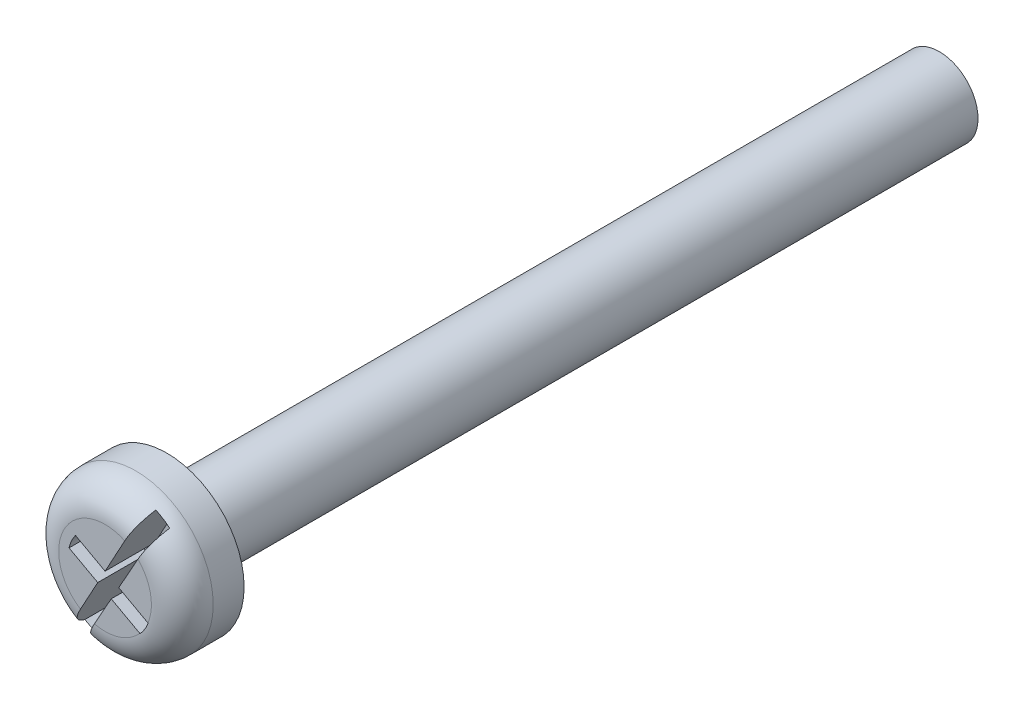
ISO-10303-21;
HEADER;
FILE_DESCRIPTION(('STEP AP214'),'2;1');
FILE_NAME('part.step','',(''),(''),'','','');
FILE_SCHEMA(('AUTOMOTIVE_DESIGN { 1 0 10303 214 1 1 1 1 }'));
ENDSEC;
DATA;
#1=APPLICATION_CONTEXT('core data for automotive mechanical design processes');
#2=APPLICATION_PROTOCOL_DEFINITION('international standard','automotive_design',2000,#1);
#3=PRODUCT_CONTEXT('',#1,'mechanical');
#4=PRODUCT('Part','Part','',(#3));
#5=PRODUCT_RELATED_PRODUCT_CATEGORY('part','',(#4));
#6=PRODUCT_DEFINITION_FORMATION('','',#4);
#7=PRODUCT_DEFINITION_CONTEXT('part definition',#1,'design');
#8=PRODUCT_DEFINITION('design','',#6,#7);
#9=PRODUCT_DEFINITION_SHAPE('','',#8);
#10=(LENGTH_UNIT() NAMED_UNIT(*) SI_UNIT(.MILLI.,.METRE.));
#11=(NAMED_UNIT(*) PLANE_ANGLE_UNIT() SI_UNIT($,.RADIAN.));
#12=(NAMED_UNIT(*) SI_UNIT($,.STERADIAN.) SOLID_ANGLE_UNIT());
#13=UNCERTAINTY_MEASURE_WITH_UNIT(LENGTH_MEASURE(1.E-05),#10,'distance_accuracy_value','');
#14=(GEOMETRIC_REPRESENTATION_CONTEXT(3) GLOBAL_UNCERTAINTY_ASSIGNED_CONTEXT((#13)) GLOBAL_UNIT_ASSIGNED_CONTEXT((#10,
#11,#12)) REPRESENTATION_CONTEXT('',''));
#15=CARTESIAN_POINT('',(0.,0.,0.));
#16=DIRECTION('',(0.,0.,1.));
#17=DIRECTION('',(1.,0.,0.));
#18=AXIS2_PLACEMENT_3D('',#15,#16,#17);
#19=CARTESIAN_POINT('',(-1.86051624597212,2.73214285714287,2.4));
#20=DIRECTION('',(0.,0.,1.));
#21=DIRECTION('',(1.,0.,0.));
#22=AXIS2_PLACEMENT_3D('',#19,#20,#21);
#23=PLANE('',#22);
#24=DIRECTION('',(-0.478292119632489,-0.87820080180871,0.));
#25=VECTOR('',#24,1.);
#26=CARTESIAN_POINT('',(-3.33454353016391,0.250826496084395,2.4));
#27=LINE('',#26,#25);
#28=CARTESIAN_POINT('',(-2.14514294385762,2.43470640062586,2.4));
#29=VERTEX_POINT('',#28);
#30=CARTESIAN_POINT('',(-2.8144800366458,1.20572447213714,2.4));
#31=VERTEX_POINT('',#30);
#32=EDGE_CURVE('E164',#29,#31,#27,.T.);
#33=ORIENTED_EDGE('',*,*,#32,.F.);
#34=DIRECTION('',(0.877616803209732,-0.479362854968896,0.));
#35=VECTOR('',#34,1.);
#36=CARTESIAN_POINT('',(-2.14514294385762,2.43470640062586,2.4));
#37=LINE('',#36,#35);
#38=CARTESIAN_POINT('',(-3.25868789679237,3.04293551135249,2.4));
#39=VERTEX_POINT('',#38);
#40=EDGE_CURVE('E166',#39,#29,#37,.T.);
#41=ORIENTED_EDGE('',*,*,#40,.F.);
#42=CARTESIAN_POINT('',(-1.86051624597212,2.73214285714287,2.4));
#43=DIRECTION('',(0.,0.,1.));
#44=DIRECTION('',(1.,0.,0.));
#45=AXIS2_PLACEMENT_3D('',#42,#43,#44);
#46=CIRCLE('',#45,1.43229746877807);
#47=CARTESIAN_POINT('',(-3.00946383602339,3.58735948138695,2.4));
#48=VERTEX_POINT('',#47);
#49=EDGE_CURVE('E207',#48,#39,#46,.T.);
#50=ORIENTED_EDGE('',*,*,#49,.F.);
#51=DIRECTION('',(-0.87756139574922,0.479464280933086,0.));
#52=VECTOR('',#51,1.);
#53=CARTESIAN_POINT('',(-1.85954831796557,2.95909185285404,2.4));
#54=LINE('',#53,#52);
#55=CARTESIAN_POINT('',(-1.85954831796557,2.95909185285404,2.4));
#56=VERTEX_POINT('',#55);
#57=EDGE_CURVE('E204',#56,#48,#54,.T.);
#58=ORIENTED_EDGE('',*,*,#57,.F.);
#59=DIRECTION('',(-0.478292119632489,-0.87820080180871,0.));
#60=VECTOR('',#59,1.);
#61=CARTESIAN_POINT('',(-1.85954831796557,2.95909185285404,2.4));
#62=LINE('',#61,#60);
#63=CARTESIAN_POINT('',(-1.09571318629089,4.36158333776873,2.4));
#64=VERTEX_POINT('',#63);
#65=EDGE_CURVE('E202',#64,#56,#62,.T.);
#66=ORIENTED_EDGE('',*,*,#65,.F.);
#67=CARTESIAN_POINT('',(-1.86051624597212,2.73214285714287,2.4));
#68=DIRECTION('',(0.,0.,1.));
#69=DIRECTION('',(1.,0.,0.));
#70=AXIS2_PLACEMENT_3D('',#67,#68,#69);
#71=CIRCLE('',#70,1.8);
#72=EDGE_CURVE('E252',#64,#31,#71,.T.);
#73=ORIENTED_EDGE('',*,*,#72,.T.);
#74=EDGE_LOOP('',(#33,#41,#50,#58,#66,#73));
#75=FACE_BOUND('',#74,.T.);
#76=ADVANCED_FACE('F32',(#75),#23,.T.);
#77=DIRECTION('',(0.488945551082672,0.872314305784596,0.));
#78=VECTOR('',#77,1.);
#79=CARTESIAN_POINT('',(-1.32937302466549,2.66942537823253,2.4));
#80=LINE('',#79,#78);
#81=CARTESIAN_POINT('',(-1.32937302466549,2.66942537823253,2.4));
#82=VERTEX_POINT('',#81);
#83=CARTESIAN_POINT('',(-0.583292168991765,4.00048770661469,2.4));
#84=VERTEX_POINT('',#83);
#85=EDGE_CURVE('E200',#82,#84,#80,.T.);
#86=ORIENTED_EDGE('',*,*,#85,.F.);
#87=DIRECTION('',(-0.87756139574922,0.479464280933086,0.));
#88=VECTOR('',#87,1.);
#89=CARTESIAN_POINT('',(-0.183967514701797,2.04362183688296,2.4));
#90=LINE('',#89,#88);
#91=CARTESIAN_POINT('',(-0.194936591049152,2.04961489939557,2.4));
#92=VERTEX_POINT('',#91);
#93=EDGE_CURVE('E198',#92,#82,#90,.T.);
#94=ORIENTED_EDGE('',*,*,#93,.F.);
#95=EDGE_CURVE('E248',#92,#84,#71,.T.);
#96=ORIENTED_EDGE('',*,*,#95,.T.);
#97=EDGE_LOOP('',(#86,#94,#96));
#98=FACE_BOUND('',#97,.T.);
#99=ADVANCED_FACE('F287',(#98),#23,.T.);
#100=CARTESIAN_POINT('',(-1.86051624597212,2.73214285714287,2.4));
#101=DIRECTION('',(0.,0.,-1.));
#102=DIRECTION('',(-1.,0.,0.));
#103=AXIS2_PLACEMENT_3D('',#100,#101,#102);
#104=CYLINDRICAL_SURFACE('',#103,3.);
#105=CARTESIAN_POINT('',(-1.86051624597212,2.73214285714287,1.2));
#106=DIRECTION('',(0.,0.,1.));
#107=DIRECTION('',(1.,0.,0.));
#108=AXIS2_PLACEMENT_3D('',#105,#106,#107);
#109=CIRCLE('',#108,3.);
#110=CARTESIAN_POINT('',(1.13948375402788,2.73214285714287,1.2));
#111=VERTEX_POINT('',#110);
#112=EDGE_CURVE('E253',#111,#111,#109,.F.);
#113=ORIENTED_EDGE('',*,*,#112,.T.);
#114=EDGE_LOOP('',(#113));
#115=FACE_BOUND('',#114,.T.);
#116=CARTESIAN_POINT('',(-1.86051624597212,2.73214285714287,0.));
#117=DIRECTION('',(0.,0.,1.));
#118=DIRECTION('',(1.,0.,0.));
#119=AXIS2_PLACEMENT_3D('',#116,#117,#118);
#120=CIRCLE('',#119,3.);
#121=CARTESIAN_POINT('',(1.13948375402788,2.73214285714287,0.));
#122=VERTEX_POINT('',#121);
#123=EDGE_CURVE('E242',#122,#122,#120,.T.);
#124=ORIENTED_EDGE('',*,*,#123,.T.);
#125=EDGE_LOOP('',(#124));
#126=FACE_BOUND('',#125,.T.);
#127=ADVANCED_FACE('F285',(#115,#126),#104,.T.);
#128=DIRECTION('',(0.877616803209732,-0.479362854968895,0.));
#129=VECTOR('',#128,1.);
#130=CARTESIAN_POINT('',(-0.499159615510704,1.53565425779784,2.4));
#131=LINE('',#130,#129);
#132=CARTESIAN_POINT('',(-1.62131210840641,2.14858489077753,2.4));
#133=VERTEX_POINT('',#132);
#134=CARTESIAN_POINT('',(-0.510336160729363,1.54175899577131,2.4));
#135=VERTEX_POINT('',#134);
#136=EDGE_CURVE('E196',#133,#135,#131,.T.);
#137=ORIENTED_EDGE('',*,*,#136,.F.);
#138=DIRECTION('',(0.488945551082672,0.872314305784596,0.));
#139=VECTOR('',#138,1.);
#140=CARTESIAN_POINT('',(-2.81993360779638,0.0101572502690064,2.4));
#141=LINE('',#140,#139);
#142=CARTESIAN_POINT('',(-2.27591252151725,0.980730303155878,2.4));
#143=VERTEX_POINT('',#142);
#144=EDGE_CURVE('E194',#143,#133,#141,.T.);
#145=ORIENTED_EDGE('',*,*,#144,.F.);
#146=EDGE_CURVE('E251',#143,#135,#71,.T.);
#147=ORIENTED_EDGE('',*,*,#146,.T.);
#148=EDGE_LOOP('',(#137,#145,#147));
#149=FACE_BOUND('',#148,.T.);
#150=ADVANCED_FACE('F282',(#149),#23,.T.);
#151=CARTESIAN_POINT('',(-1.86051624597212,2.73214285714287,0.));
#152=DIRECTION('',(0.,0.,1.));
#153=DIRECTION('',(1.,0.,0.));
#154=AXIS2_PLACEMENT_3D('',#151,#152,#153);
#155=PLANE('',#154);
#156=CARTESIAN_POINT('',(-1.86051624597212,2.73214285714287,0.));
#157=DIRECTION('',(0.,0.,1.));
#158=DIRECTION('',(1.,0.,0.));
#159=AXIS2_PLACEMENT_3D('',#156,#157,#158);
#160=CIRCLE('',#159,1.5);
#161=CARTESIAN_POINT('',(-0.360516245972119,2.73214285714287,0.));
#162=VERTEX_POINT('',#161);
#163=EDGE_CURVE('E245',#162,#162,#160,.F.);
#164=ORIENTED_EDGE('',*,*,#163,.F.);
#165=EDGE_LOOP('',(#164));
#166=FACE_BOUND('',#165,.T.);
#167=ORIENTED_EDGE('',*,*,#123,.F.);
#168=EDGE_LOOP('',(#167));
#169=FACE_BOUND('',#168,.T.);
#170=ADVANCED_FACE('F280',(#166,#169),#155,.F.);
#171=CARTESIAN_POINT('',(-1.86051624597212,2.73214285714287,-30.));
#172=DIRECTION('',(0.,0.,1.));
#173=DIRECTION('',(1.,0.,0.));
#174=AXIS2_PLACEMENT_3D('',#171,#172,#173);
#175=CYLINDRICAL_SURFACE('',#174,1.5);
#176=CARTESIAN_POINT('',(-1.86051624597212,2.73214285714287,-30.));
#177=DIRECTION('',(0.,0.,-1.));
#178=DIRECTION('',(-1.,0.,0.));
#179=AXIS2_PLACEMENT_3D('',#176,#177,#178);
#180=CIRCLE('',#179,1.5);
#181=CARTESIAN_POINT('',(-3.36051624597212,2.73214285714287,-30.));
#182=VERTEX_POINT('',#181);
#183=EDGE_CURVE('E214',#182,#182,#180,.T.);
#184=ORIENTED_EDGE('',*,*,#183,.F.);
#185=EDGE_LOOP('',(#184));
#186=FACE_BOUND('',#185,.T.);
#187=ORIENTED_EDGE('',*,*,#163,.T.);
#188=EDGE_LOOP('',(#187));
#189=FACE_BOUND('',#188,.T.);
#190=ADVANCED_FACE('F276',(#186,#189),#175,.T.);
#191=CARTESIAN_POINT('',(-1.86051624597212,2.73214285714287,-30.));
#192=DIRECTION('',(0.,0.,-1.));
#193=DIRECTION('',(-1.,0.,0.));
#194=AXIS2_PLACEMENT_3D('',#191,#192,#193);
#195=PLANE('',#194);
#196=ORIENTED_EDGE('',*,*,#183,.T.);
#197=EDGE_LOOP('',(#196));
#198=FACE_BOUND('',#197,.T.);
#199=ADVANCED_FACE('F273',(#198),#195,.T.);
#200=CARTESIAN_POINT('',(-1.86051624597212,2.73214285714287,1.2));
#201=DIRECTION('',(0.,0.,1.));
#202=DIRECTION('',(1.,0.,0.));
#203=AXIS2_PLACEMENT_3D('',#200,#201,#202);
#204=TOROIDAL_SURFACE('',#203,1.8,1.2);
#205=CARTESIAN_POINT('',(-0.575540767315494,5.31668131382147,1.70975429270533));
#206=CARTESIAN_POINT('',(-0.5824043740871,5.3040789214284,1.74031456902629));
#207=CARTESIAN_POINT('',(-0.58988200536983,5.29034910753732,1.77025412843296));
#208=CARTESIAN_POINT('',(-0.606016263850412,5.26072470405536,1.82870871238285));
#209=CARTESIAN_POINT('',(-0.614672831189766,5.24483022437174,1.85722380915036));
#210=CARTESIAN_POINT('',(-0.642308509018158,5.19408785703759,1.94027220578123));
#211=CARTESIAN_POINT('',(-0.6629762437161,5.15613945596996,1.99240919048908));
#212=CARTESIAN_POINT('',(-0.708203159379022,5.07309749903989,2.08868631517981));
#213=CARTESIAN_POINT('',(-0.732764089691729,5.02800073116848,2.1328228410772));
#214=CARTESIAN_POINT('',(-0.785077689775711,4.931946784943,2.21185265354796));
#215=CARTESIAN_POINT('',(-0.812829752078776,4.88099072197227,2.24674769517889));
#216=CARTESIAN_POINT('',(-0.870755055483799,4.77463302589651,2.30632883547805));
#217=CARTESIAN_POINT('',(-0.900929651552919,4.71922890491179,2.33100917270618));
#218=CARTESIAN_POINT('',(-0.96283568336023,4.6055621214997,2.3694469225507));
#219=CARTESIAN_POINT('',(-0.994567368093604,4.54729900188777,2.38320258211041));
#220=CARTESIAN_POINT('',(-1.05872386347642,4.42950010164723,2.39941483191493));
#221=CARTESIAN_POINT('',(-1.09114948115231,4.36996283922278,2.40185745763308));
#222=CARTESIAN_POINT('',(-1.15573526747496,4.25137571013191,2.3953503202161));
#223=CARTESIAN_POINT('',(-1.18789545531375,4.19232580822668,2.38640138814567));
#224=CARTESIAN_POINT('',(-1.25111142223883,4.07625382927923,2.35735083248507));
#225=CARTESIAN_POINT('',(-1.28216478936063,4.01923618088856,2.33722626866415));
#226=CARTESIAN_POINT('',(-1.34222441899033,3.90895960987239,2.28639254421336));
#227=CARTESIAN_POINT('',(-1.37123050343914,3.85570101418436,2.25568246428877));
#228=CARTESIAN_POINT('',(-1.42645974489832,3.75429360615512,2.18445449366384));
#229=CARTESIAN_POINT('',(-1.45267457095233,3.7061600904334,2.14390836466459));
#230=CARTESIAN_POINT('',(-1.50148430909094,3.6165396484275,2.05421363754392));
#231=CARTESIAN_POINT('',(-1.52407946375269,3.57505227674305,2.00506561635217));
#232=CARTESIAN_POINT('',(-1.56505668794341,3.49981325510113,1.89942416088343));
#233=CARTESIAN_POINT('',(-1.58342918956016,3.46607917296016,1.84291449103487));
#234=CARTESIAN_POINT('',(-1.61535277583557,3.40746369945995,1.72423224566163));
#235=CARTESIAN_POINT('',(-1.62890390546596,3.38258222552731,1.66205972296445));
#236=CARTESIAN_POINT('',(-1.65068064383632,3.3425975627812,1.53419605152068));
#237=CARTESIAN_POINT('',(-1.65894166858414,3.32742934599587,1.46853155927476));
#238=CARTESIAN_POINT('',(-1.66723338993673,3.31220476661996,1.36857431614967));
#239=CARTESIAN_POINT('',(-1.66931401785529,3.30838448810952,1.33497508943135));
#240=CARTESIAN_POINT('',(-1.67209007621539,3.30328731720154,1.26752282072818));
#241=CARTESIAN_POINT('',(-1.67278531621524,3.30201077447743,1.23366974448996));
#242=CARTESIAN_POINT('',(-1.67278220669648,3.302016483921,1.1998));
#243=B_SPLINE_CURVE_WITH_KNOTS('',3,(#205,#206,#207,#208,#209,#210,#211,#212,#213,#214,#215,
#216,#217,#218,#219,#220,#221,#222,#223,#224,#225,#226,#227,#228,#229,#230,#231,#232,#233,#234,
#235,#236,#237,#238,#239,#240,#241,#242),.UNSPECIFIED.,.F.,.F.,(4,2,2,2,2,2,2,2,2,2,2,2,2,2,2,2,
2,2,4),(0.,0.101223158894359,0.202441180267574,0.404547966509414,0.606745825117994,
0.808905256591363,1.01117855796459,1.21348431109243,1.41603971895592,1.61858035035038,
1.82153828216889,2.02451384422666,2.22807917195367,2.43163085176484,2.63563930015266,
2.83964584558596,3.04227192850753,3.1438024334223,3.24534689421735),.UNSPECIFIED.);
#244=CARTESIAN_POINT('',(-0.575649692772779,5.31648131382147,1.71023901109821));
#245=VERTEX_POINT('',#244);
#246=EDGE_CURVE('E11',#245,#64,#243,.T.);
#247=ORIENTED_EDGE('',*,*,#246,.F.);
#248=CARTESIAN_POINT('',(-1.86051624597212,2.73214285714287,1.71023901109821));
#249=DIRECTION('',(0.,0.,-1.));
#250=DIRECTION('',(-1.,0.,0.));
#251=AXIS2_PLACEMENT_3D('',#248,#249,#250);
#252=CIRCLE('',#251,2.88611976851244);
#253=CARTESIAN_POINT('',(-0.0392710827126332,4.97106075950156,1.71023901109827));
#254=VERTEX_POINT('',#253);
#255=EDGE_CURVE('E45',#254,#245,#252,.F.);
#256=ORIENTED_EDGE('',*,*,#255,.F.);
#257=CARTESIAN_POINT('',(-1.26309170389054,2.78767605909107,1.1998));
#258=CARTESIAN_POINT('',(-1.2631127720155,2.78763847202896,1.22576998040815));
#259=CARTESIAN_POINT('',(-1.26237301012876,2.78895826085872,1.25170198029709));
#260=CARTESIAN_POINT('',(-1.25952072671015,2.79404694123365,1.30315668634531));
#261=CARTESIAN_POINT('',(-1.25741325248622,2.79780682801559,1.32868054522842));
#262=CARTESIAN_POINT('',(-1.24932506804159,2.81223673536059,1.40375196214292));
#263=CARTESIAN_POINT('',(-1.24157094586872,2.8260706513973,1.45250594024511));
#264=CARTESIAN_POINT('',(-1.22556622491573,2.8546242337266,1.53282213605265));
#265=CARTESIAN_POINT('',(-1.21816574900715,2.86782721919272,1.56514626066184));
#266=CARTESIAN_POINT('',(-1.20205095375697,2.89657718204726,1.62840310857575));
#267=CARTESIAN_POINT('',(-1.19333633706057,2.9121246899382,1.65933551490998));
#268=CARTESIAN_POINT('',(-1.16542086668087,2.96192791263038,1.75044821489817));
#269=CARTESIAN_POINT('',(-1.14454383968645,2.99917404212099,1.80849742576797));
#270=CARTESIAN_POINT('',(-1.09772220899005,3.08270722528668,1.92199684801045));
#271=CARTESIAN_POINT('',(-1.07153445687538,3.12942807335531,1.9770243073677));
#272=CARTESIAN_POINT('',(-1.01564250198845,3.22914337236595,2.07869204050147));
#273=CARTESIAN_POINT('',(-0.985948470618887,3.28211967678826,2.12535563158695));
#274=CARTESIAN_POINT('',(-0.918223441287482,3.40294603836298,2.21601487520697));
#275=CARTESIAN_POINT('',(-0.879627663676285,3.47180370334956,2.25827105625763));
#276=CARTESIAN_POINT('',(-0.799196938468586,3.61529794737724,2.32733623557769));
#277=CARTESIAN_POINT('',(-0.75735970921051,3.68993859706798,2.35413423868104));
#278=CARTESIAN_POINT('',(-0.676058999745624,3.83498495607384,2.38861679562639));
#279=CARTESIAN_POINT('',(-0.636757731729013,3.90510126708322,2.39790034547785));
#280=CARTESIAN_POINT('',(-0.558000185780485,4.04561043802723,2.40146077706672));
#281=CARTESIAN_POINT('',(-0.518544054122394,4.11600303699876,2.39574945908726));
#282=CARTESIAN_POINT('',(-0.444261504767299,4.24852848963682,2.3702843287041));
#283=CARTESIAN_POINT('',(-0.409330772893901,4.31084744735557,2.35179428040256));
#284=CARTESIAN_POINT('',(-0.341616033942729,4.43165545014603,2.30246954631037));
#285=CARTESIAN_POINT('',(-0.308831410977736,4.49014559400518,2.27163842037526));
#286=CARTESIAN_POINT('',(-0.248009519737374,4.59865625683126,2.20022273119116));
#287=CARTESIAN_POINT('',(-0.219819428476118,4.64894942308283,2.16018125447389));
#288=CARTESIAN_POINT('',(-0.167249114151315,4.74273867455178,2.0707446602969));
#289=CARTESIAN_POINT('',(-0.142866729021386,4.78623861705231,2.02135488642782));
#290=CARTESIAN_POINT('',(-0.10452820364559,4.85463732540325,1.92879061961627));
#291=CARTESIAN_POINT('',(-0.08951899805589,4.88141483616159,1.88741844310844));
#292=CARTESIAN_POINT('',(-0.0622349441551543,4.93009156608522,1.80110482457957));
#293=CARTESIAN_POINT('',(-0.0499580968395804,4.95199435161951,1.75616602478609));
#294=CARTESIAN_POINT('',(-0.0391589796443221,4.97126075950155,1.70975788936457));
#295=B_SPLINE_CURVE_WITH_KNOTS('',3,(#257,#258,#259,#260,#261,#262,#263,#264,#265,#266,#267,
#268,#269,#270,#271,#272,#273,#274,#275,#276,#277,#278,#279,#280,#281,#282,#283,#284,#285,#286,
#287,#288,#289,#290,#291,#292,#293,#294),.UNSPECIFIED.,.F.,.F.,(4,2,2,2,2,2,2,2,2,2,2,2,2,2,2,2,
2,2,4),(0.,0.0778006917118378,0.155315893483458,0.308266870217621,0.415234357270093,
0.522226084613864,0.737655839714488,0.967269406588131,1.19623253348757,1.46333863997643,
1.73063450143458,1.97205770050909,2.21329096739737,2.43355558113201,2.65375670399323,
2.86332090395877,3.07276567449364,3.22690773757732,3.38093665626108),.UNSPECIFIED.);
#296=EDGE_CURVE('E353',#84,#254,#295,.T.);
#297=ORIENTED_EDGE('',*,*,#296,.F.);
#298=ORIENTED_EDGE('',*,*,#95,.F.);
#299=CARTESIAN_POINT('',(-0.183767514701797,2.04351256492016,2.39993332802436));
#300=CARTESIAN_POINT('',(-0.217782658736837,2.06209707268747,2.40033863472729));
#301=CARTESIAN_POINT('',(-0.251792157132213,2.08067849590415,2.39888813616958));
#302=CARTESIAN_POINT('',(-0.319534364168039,2.11769011553849,2.39230484226138));
#303=CARTESIAN_POINT('',(-0.353267082920302,2.13612031748085,2.38717218204555));
#304=CARTESIAN_POINT('',(-0.453400795391146,2.19082935399903,2.36634775777888));
#305=CARTESIAN_POINT('',(-0.519000364428353,2.22667032233503,2.34523208484704));
#306=CARTESIAN_POINT('',(-0.638425774554932,2.29191956719567,2.2925053228282));
#307=CARTESIAN_POINT('',(-0.69274889876274,2.32159953923238,2.26232665392895));
#308=CARTESIAN_POINT('',(-0.796253299526463,2.37815018437923,2.19212147821412));
#309=CARTESIAN_POINT('',(-0.845435603131863,2.40502141862793,2.1520969438157));
#310=CARTESIAN_POINT('',(-0.93783514695995,2.45550481620521,2.0628344484937));
#311=CARTESIAN_POINT('',(-0.980978593060597,2.47907666139099,2.01349735883978));
#312=CARTESIAN_POINT('',(-1.05943191653211,2.5219404046086,1.90725218211608));
#313=CARTESIAN_POINT('',(-1.09473743753789,2.5412299224976,1.85033991268358));
#314=CARTESIAN_POINT('',(-1.15640863612218,2.57492458708373,1.73042207813507));
#315=CARTESIAN_POINT('',(-1.18276106492887,2.58932249518434,1.66740765860267));
#316=CARTESIAN_POINT('',(-1.22535753184498,2.61259549292461,1.53714360818663));
#317=CARTESIAN_POINT('',(-1.24161903914605,2.62148012702857,1.46990151973345));
#318=CARTESIAN_POINT('',(-1.25768366139594,2.6302571910526,1.36830312947122));
#319=CARTESIAN_POINT('',(-1.26165056048128,2.63242454529892,1.33474662578359));
#320=CARTESIAN_POINT('',(-1.266942961413,2.63531610048746,1.26739967422531));
#321=CARTESIAN_POINT('',(-1.26827119793696,2.6360417955476,1.23360950501902));
#322=CARTESIAN_POINT('',(-1.26826312586215,2.63603738529031,1.1998));
#323=B_SPLINE_CURVE_WITH_KNOTS('',3,(#299,#300,#301,#302,#303,#304,#305,#306,#307,#308,#309,
#310,#311,#312,#313,#314,#315,#316,#317,#318,#319,#320,#321,#322),.UNSPECIFIED.,.F.,.F.,(4,2,2,
2,2,2,2,2,2,2,2,4),(0.,0.116194057201358,0.232383850320403,0.463878668865414,0.66956690126712,
0.875213961759851,1.08318799595766,1.29127733555275,1.49967327769664,1.70770743525587,
1.80916908072369,1.91052551761236),.UNSPECIFIED.);
#324=CARTESIAN_POINT('',(-0.183967514701797,2.04362183688296,2.39993569454367));
#325=VERTEX_POINT('',#324);
#326=EDGE_CURVE('E358',#325,#92,#323,.T.);
#327=ORIENTED_EDGE('',*,*,#326,.F.);
#328=CARTESIAN_POINT('',(-1.86051624597212,2.73214285714287,2.39993569454367));
#329=DIRECTION('',(0.,0.,-1.));
#330=DIRECTION('',(-1.,0.,0.));
#331=AXIS2_PLACEMENT_3D('',#328,#329,#330);
#332=CIRCLE('',#331,1.81242292075108);
#333=CARTESIAN_POINT('',(-0.499159615510704,1.53565425779784,2.39993569454353));
#334=VERTEX_POINT('',#333);
#335=EDGE_CURVE('E311',#334,#325,#332,.F.);
#336=ORIENTED_EDGE('',*,*,#335,.F.);
#337=CARTESIAN_POINT('',(-1.62151210840638,2.14869413272758,1.46884807485071));
#338=CARTESIAN_POINT('',(-1.61337014202699,2.14424691130428,1.50015816020714));
#339=CARTESIAN_POINT('',(-1.60395340171439,2.13910339592918,1.53100343533154));
#340=CARTESIAN_POINT('',(-1.58283284504561,2.12756714194424,1.59162369108894));
#341=CARTESIAN_POINT('',(-1.57113159541627,2.12117580530562,1.62139982889169));
#342=CARTESIAN_POINT('',(-1.53304521941817,2.10037265538062,1.70882633846756));
#343=CARTESIAN_POINT('',(-1.50362091999362,2.08430081613823,1.76478080452301));
#344=CARTESIAN_POINT('',(-1.43685873996878,2.0478346624552,1.87328351003643));
#345=CARTESIAN_POINT('',(-1.39926537871097,2.02730080198841,1.92562519772884));
#346=CARTESIAN_POINT('',(-1.31781577832807,1.98281223609858,2.02368680610002));
#347=CARTESIAN_POINT('',(-1.27395030371921,1.95885248616424,2.06939675818379));
#348=CARTESIAN_POINT('',(-1.17347767984285,1.90397335936148,2.15971584324997));
#349=CARTESIAN_POINT('',(-1.11595236120694,1.87255246943155,2.2030105340935));
#350=CARTESIAN_POINT('',(-0.99525776678779,1.80662790514737,2.27762475239334));
#351=CARTESIAN_POINT('',(-0.93209357834735,1.77212700954936,2.30895494207597));
#352=CARTESIAN_POINT('',(-0.807854099588225,1.70426619487488,2.35608316652604));
#353=CARTESIAN_POINT('',(-0.747121541030133,1.67109347922781,2.37304527651785));
#354=CARTESIAN_POINT('',(-0.654777795629045,1.6206544251075,2.38976872479177));
#355=CARTESIAN_POINT('',(-0.623736747104048,1.6036995017426,2.39388947843407));
#356=CARTESIAN_POINT('',(-0.561450947954723,1.56967839093998,2.39915564694617));
#357=CARTESIAN_POINT('',(-0.530206133741795,1.55261216876954,2.40030008361231));
#358=CARTESIAN_POINT('',(-0.498959615510704,1.53554501584778,2.39993337202856));
#359=B_SPLINE_CURVE_WITH_KNOTS('',3,(#337,#338,#339,#340,#341,#342,#343,#344,#345,#346,#347,
#348,#349,#350,#351,#352,#353,#354,#355,#356,#357,#358),.UNSPECIFIED.,.F.,.F.,(4,2,2,2,2,2,2,2,
2,2,4),(0.,0.0978774872130326,0.195645631969167,0.390542213792294,0.592750808490968,
0.795260275068813,1.02975854366474,1.26404734754404,1.47677448793309,1.58349124104491,
1.69024306351729),.UNSPECIFIED.);
#360=EDGE_CURVE('E310',#135,#334,#359,.T.);
#361=ORIENTED_EDGE('',*,*,#360,.F.);
#362=ORIENTED_EDGE('',*,*,#146,.F.);
#363=CARTESIAN_POINT('',(-2.8200457108647,0.00995725026900685,1.70975788936454));
#364=CARTESIAN_POINT('',(-2.81294284402451,0.022629279584052,1.74025937821588));
#365=CARTESIAN_POINT('',(-2.80520776699475,0.0364292177048946,1.77012651441064));
#366=CARTESIAN_POINT('',(-2.78852805075133,0.0661870405613481,1.82840858711255));
#367=CARTESIAN_POINT('',(-2.77958354431484,0.0821446884128344,1.85682368256077));
#368=CARTESIAN_POINT('',(-2.75105867197416,0.133035128377685,1.93950073195886));
#369=CARTESIAN_POINT('',(-2.72975432624299,0.171043625470118,1.99133402140313));
#370=CARTESIAN_POINT('',(-2.68321245334617,0.254077700442272,2.08695288085192));
#371=CARTESIAN_POINT('',(-2.65797425673365,0.299104472663766,2.13073707832536));
#372=CARTESIAN_POINT('',(-2.60429647966901,0.394869517938271,2.20913797564933));
#373=CARTESIAN_POINT('',(-2.57585694671416,0.445607706252732,2.24375481148769));
#374=CARTESIAN_POINT('',(-2.51624584523596,0.551958232375456,2.30332144687179));
#375=CARTESIAN_POINT('',(-2.48504637325386,0.607620351976805,2.32815425531122));
#376=CARTESIAN_POINT('',(-2.42108372755138,0.721734348430112,2.36706399353599));
#377=CARTESIAN_POINT('',(-2.38832028354668,0.780186707488876,2.38113905697485));
#378=CARTESIAN_POINT('',(-2.3212205298552,0.899897531997037,2.39860255480028));
#379=CARTESIAN_POINT('',(-2.28686565282517,0.961189122932676,2.40169129859643));
#380=CARTESIAN_POINT('',(-2.21836196694208,1.08340466423881,2.39656212253163));
#381=CARTESIAN_POINT('',(-2.18421320380919,1.14432853304119,2.38834178043095));
#382=CARTESIAN_POINT('',(-2.11541314916736,1.26707281769608,2.36052733205186));
#383=CARTESIAN_POINT('',(-2.08081091742779,1.32880570736378,2.34042775974803));
#384=CARTESIAN_POINT('',(-2.01358345624662,1.4487443712908,2.28946888113319));
#385=CARTESIAN_POINT('',(-1.98095779999344,1.5069509070129,2.25861190751046));
#386=CARTESIAN_POINT('',(-1.91595930201837,1.6229129390073,2.1846794657163));
#387=CARTESIAN_POINT('',(-1.88378883195749,1.68030738956684,2.14086134133571));
#388=CARTESIAN_POINT('',(-1.82299040998259,1.78877618152209,2.04373589253331));
#389=CARTESIAN_POINT('',(-1.79437078554514,1.83983566609596,1.99040695083443));
#390=CARTESIAN_POINT('',(-1.74170793806781,1.93379000341657,1.87684814417621));
#391=CARTESIAN_POINT('',(-1.71758927738487,1.97681944238683,1.81676563764669));
#392=CARTESIAN_POINT('',(-1.68499473938053,2.03497046089731,1.72173769517997));
#393=CARTESIAN_POINT('',(-1.67474067883886,2.05326444819932,1.68930008901254));
#394=CARTESIAN_POINT('',(-1.65560220426437,2.0874088741487,1.62278687505944));
#395=CARTESIAN_POINT('',(-1.64671642517575,2.10326174815456,1.58871294486205));
#396=CARTESIAN_POINT('',(-1.6354763758506,2.12331481091859,1.53995134726292));
#397=CARTESIAN_POINT('',(-1.63241040549437,2.12878472427997,1.52594181495768));
#398=CARTESIAN_POINT('',(-1.62657512176459,2.13919529344156,1.49766364899058));
#399=CARTESIAN_POINT('',(-1.62380587038182,2.14413583864574,1.48339496191127));
#400=CARTESIAN_POINT('',(-1.6212000053383,2.14878489077715,1.46899770049256));
#401=B_SPLINE_CURVE_WITH_KNOTS('',3,(#363,#364,#365,#366,#367,#368,#369,#370,#371,#372,#373,
#374,#375,#376,#377,#378,#379,#380,#381,#382,#383,#384,#385,#386,#387,#388,#389,#390,#391,#392,
#393,#394,#395,#396,#397,#398,#399,#400),.UNSPECIFIED.,.F.,.F.,(4,2,2,2,2,2,2,2,2,2,2,2,2,2,2,2,
2,2,4),(0.,0.101288992601227,0.202566874207223,0.404664504390113,0.606796564357891,
0.808925625748703,1.01340315711687,1.21791615496524,1.42796691929092,1.63806268040327,
1.85781625970006,2.07752221615008,2.31370147648449,2.5504245572661,2.78272989816584,
2.89851304910329,3.0141799308455,3.06021461907438,3.10625890623177),.UNSPECIFIED.);
#402=CARTESIAN_POINT('',(-2.81993360779156,0.0101572502776019,1.71023901111888));
#403=VERTEX_POINT('',#402);
#404=EDGE_CURVE('E256',#403,#143,#401,.T.);
#405=ORIENTED_EDGE('',*,*,#404,.F.);
#406=CARTESIAN_POINT('',(-1.86051624597212,2.73214285714287,1.71023901109822));
#407=DIRECTION('',(0.,0.,-1.));
#408=DIRECTION('',(-1.,0.,0.));
#409=AXIS2_PLACEMENT_3D('',#406,#407,#408);
#410=CIRCLE('',#409,2.88611976851244);
#411=CARTESIAN_POINT('',(-3.33454353016391,0.250826496084395,1.71023901109839));
#412=VERTEX_POINT('',#411);
#413=EDGE_CURVE('E147',#412,#403,#410,.F.);
#414=ORIENTED_EDGE('',*,*,#413,.F.);
#415=CARTESIAN_POINT('',(-2.23741101624021,2.26529132598487,1.1998));
#416=CARTESIAN_POINT('',(-2.23740798207602,2.26529689706855,1.23311773914182));
#417=CARTESIAN_POINT('',(-2.23808067093128,2.26406176090843,1.26641957114974));
#418=CARTESIAN_POINT('',(-2.24076710911818,2.25912914321957,1.33278175952951));
#419=CARTESIAN_POINT('',(-2.242780689134,2.25543197257465,1.36584214585618));
#420=CARTESIAN_POINT('',(-2.25080606757614,2.24069643022843,1.46421986667473));
#421=CARTESIAN_POINT('',(-2.25880259100748,2.22601386908886,1.52887702678378));
#422=CARTESIAN_POINT('',(-2.27983915454845,2.18738825471918,1.65459016266913));
#423=CARTESIAN_POINT('',(-2.29288843169437,2.16342824119987,1.71563930558337));
#424=CARTESIAN_POINT('',(-2.32363131516378,2.10698067745266,1.83240079175109));
#425=CARTESIAN_POINT('',(-2.34132519302719,2.07449262864539,1.88811282271796));
#426=CARTESIAN_POINT('',(-2.38115513632148,2.00136015018449,1.99348291171297));
#427=CARTESIAN_POINT('',(-2.40335437218142,1.96059973216481,2.04303659878605));
#428=CARTESIAN_POINT('',(-2.4513978021071,1.87238632251299,2.13371393052453));
#429=CARTESIAN_POINT('',(-2.47724247281079,1.82493245571732,2.17483647109585));
#430=CARTESIAN_POINT('',(-2.53202000366664,1.72435444168758,2.24770555401301));
#431=CARTESIAN_POINT('',(-2.5609706987514,1.67119754741156,2.27939351984365));
#432=CARTESIAN_POINT('',(-2.62100717148868,1.5609634951839,2.3321349510837));
#433=CARTESIAN_POINT('',(-2.65209280048278,1.50388661018668,2.35318915608555));
#434=CARTESIAN_POINT('',(-2.715459985346,1.38753697725104,2.38402091071262));
#435=CARTESIAN_POINT('',(-2.74773931345678,1.32826831973999,2.39381847050695));
#436=CARTESIAN_POINT('',(-2.81262891214323,1.20912335527922,2.40190903095553));
#437=CARTESIAN_POINT('',(-2.84523920539102,1.1492470067008,2.40020123807361));
#438=CARTESIAN_POINT('',(-2.90976172307835,1.03077604629428,2.3853359072085));
#439=CARTESIAN_POINT('',(-2.94167569398232,0.972178227751287,2.37221150496673));
#440=CARTESIAN_POINT('',(-3.00398675295645,0.857767766640874,2.33492525045804));
#441=CARTESIAN_POINT('',(-3.03438411411032,0.801954622659517,2.31076539327067));
#442=CARTESIAN_POINT('',(-3.09273596313708,0.6948137384616,2.2521514303079));
#443=CARTESIAN_POINT('',(-3.12069564895239,0.64347645420905,2.21771995706866));
#444=CARTESIAN_POINT('',(-3.1734523737464,0.546608878697876,2.13952114974382));
#445=CARTESIAN_POINT('',(-3.19824869151269,0.501079911670375,2.09575169275951));
#446=CARTESIAN_POINT('',(-3.2445007498667,0.416155671724698,1.99898020102851));
#447=CARTESIAN_POINT('',(-3.2658668259731,0.376925033380575,1.94578943219456));
#448=CARTESIAN_POINT('',(-3.29438735791881,0.324557969415617,1.86087349664456));
#449=CARTESIAN_POINT('',(-3.30331296750969,0.308169496393382,1.83168275144308));
#450=CARTESIAN_POINT('',(-3.31992520204965,0.277667472433556,1.77179737413023));
#451=CARTESIAN_POINT('',(-3.32761178275446,0.263554002733655,1.74110268836594));
#452=CARTESIAN_POINT('',(-3.3346524556212,0.250626496084396,1.70975429270533));
#453=B_SPLINE_CURVE_WITH_KNOTS('',3,(#415,#416,#417,#418,#419,#420,#421,#422,#423,#424,#425,
#426,#427,#428,#429,#430,#431,#432,#433,#434,#435,#436,#437,#438,#439,#440,#441,#442,#443,#444,
#445,#446,#447,#448,#449,#450,#451,#452),.UNSPECIFIED.,.F.,.F.,(4,2,2,2,2,2,2,2,2,2,2,2,2,2,2,2,
2,2,4),(0.,0.0998914587792622,0.199770306544799,0.39910369637716,0.59880322511113,
0.798514431593275,1.00124780839576,1.20400771705243,1.40800143848499,1.61198096992408,
1.81559733711599,2.01922774808509,2.22226910362057,2.42527376620348,2.62783439007704,
2.83044111327975,3.03769485368784,3.14152109707258,3.24535104714929),.UNSPECIFIED.);
#454=EDGE_CURVE('E60',#31,#412,#453,.T.);
#455=ORIENTED_EDGE('',*,*,#454,.F.);
#456=ORIENTED_EDGE('',*,*,#72,.F.);
#457=EDGE_LOOP('',(#247,#256,#297,#298,#327,#336,#361,#362,#405,#414,#455,#456));
#458=FACE_BOUND('',#457,.T.);
#459=ORIENTED_EDGE('',*,*,#112,.F.);
#460=EDGE_LOOP('',(#459));
#461=FACE_BOUND('',#460,.T.);
#462=ADVANCED_FACE('F34',(#458,#461),#204,.T.);
#463=CARTESIAN_POINT('',(-1.86051624597212,2.73214285714287,0.46));
#464=DIRECTION('',(0.,0.,1.));
#465=DIRECTION('',(1.,0.,0.));
#466=AXIS2_PLACEMENT_3D('',#463,#464,#465);
#467=CYLINDRICAL_SURFACE('',#466,2.88611976851244);
#468=ORIENTED_EDGE('',*,*,#413,.T.);
#469=DIRECTION('',(0.,0.,1.));
#470=VECTOR('',#469,1.);
#471=CARTESIAN_POINT('',(-2.81993360779638,0.0101572502690064,0.46));
#472=LINE('',#471,#470);
#473=CARTESIAN_POINT('',(-2.81993360779638,0.0101572502690064,0.46));
#474=VERTEX_POINT('',#473);
#475=EDGE_CURVE('E52',#474,#403,#472,.T.);
#476=ORIENTED_EDGE('',*,*,#475,.F.);
#477=CARTESIAN_POINT('',(-1.86051624597212,2.73214285714287,0.46));
#478=DIRECTION('',(0.,0.,1.));
#479=DIRECTION('',(1.,0.,0.));
#480=AXIS2_PLACEMENT_3D('',#477,#478,#479);
#481=CIRCLE('',#480,2.88611976851244);
#482=CARTESIAN_POINT('',(-3.33454353016391,0.250826496084395,0.46));
#483=VERTEX_POINT('',#482);
#484=EDGE_CURVE('E144',#483,#474,#481,.T.);
#485=ORIENTED_EDGE('',*,*,#484,.F.);
#486=DIRECTION('',(0.,0.,1.));
#487=VECTOR('',#486,1.);
#488=CARTESIAN_POINT('',(-3.33454353016391,0.250826496084395,0.46));
#489=LINE('',#488,#487);
#490=EDGE_CURVE('E212',#483,#412,#489,.T.);
#491=ORIENTED_EDGE('',*,*,#490,.T.);
#492=EDGE_LOOP('',(#468,#476,#485,#491));
#493=FACE_BOUND('',#492,.T.);
#494=ADVANCED_FACE('F142',(#493),#467,.F.);
#495=CARTESIAN_POINT('',(-3.33454353016391,0.250826496084395,0.46));
#496=DIRECTION('',(-0.87820080180871,0.478292119632489,0.));
#497=DIRECTION('',(-0.478292119632489,-0.87820080180871,0.));
#498=AXIS2_PLACEMENT_3D('',#495,#496,#497);
#499=PLANE('',#498);
#500=ORIENTED_EDGE('',*,*,#454,.T.);
#501=ORIENTED_EDGE('',*,*,#490,.F.);
#502=DIRECTION('',(-0.478292119632489,-0.87820080180871,0.));
#503=VECTOR('',#502,1.);
#504=CARTESIAN_POINT('',(-3.33454353016391,0.250826496084395,0.46));
#505=LINE('',#504,#503);
#506=CARTESIAN_POINT('',(-2.14514294385762,2.43470640062586,0.46));
#507=VERTEX_POINT('',#506);
#508=EDGE_CURVE('E150',#507,#483,#505,.T.);
#509=ORIENTED_EDGE('',*,*,#508,.F.);
#510=DIRECTION('',(0.,0.,1.));
#511=VECTOR('',#510,1.);
#512=CARTESIAN_POINT('',(-2.14514294385762,2.43470640062586,0.46));
#513=LINE('',#512,#511);
#514=EDGE_CURVE('E215',#507,#29,#513,.T.);
#515=ORIENTED_EDGE('',*,*,#514,.T.);
#516=ORIENTED_EDGE('',*,*,#32,.T.);
#517=EDGE_LOOP('',(#500,#501,#509,#515,#516));
#518=FACE_BOUND('',#517,.T.);
#519=ADVANCED_FACE('F272',(#518),#499,.F.);
#520=CARTESIAN_POINT('',(-2.14514294385762,2.43470640062586,0.46));
#521=DIRECTION('',(-0.479362854968896,-0.877616803209732,0.));
#522=DIRECTION('',(0.877616803209732,-0.479362854968896,0.));
#523=AXIS2_PLACEMENT_3D('',#520,#521,#522);
#524=PLANE('',#523);
#525=ORIENTED_EDGE('',*,*,#40,.T.);
#526=ORIENTED_EDGE('',*,*,#514,.F.);
#527=DIRECTION('',(0.877616803209732,-0.479362854968896,0.));
#528=VECTOR('',#527,1.);
#529=CARTESIAN_POINT('',(-2.14514294385762,2.43470640062586,0.46));
#530=LINE('',#529,#528);
#531=CARTESIAN_POINT('',(-3.25868789679237,3.04293551135249,0.46));
#532=VERTEX_POINT('',#531);
#533=EDGE_CURVE('E191',#532,#507,#530,.T.);
#534=ORIENTED_EDGE('',*,*,#533,.F.);
#535=DIRECTION('',(0.,0.,1.));
#536=VECTOR('',#535,1.);
#537=CARTESIAN_POINT('',(-3.25868789679237,3.04293551135249,0.46));
#538=LINE('',#537,#536);
#539=EDGE_CURVE('E217',#532,#39,#538,.T.);
#540=ORIENTED_EDGE('',*,*,#539,.T.);
#541=EDGE_LOOP('',(#525,#526,#534,#540));
#542=FACE_BOUND('',#541,.T.);
#543=ADVANCED_FACE('F325',(#542),#524,.F.);
#544=CARTESIAN_POINT('',(-1.86051624597212,2.73214285714287,0.46));
#545=DIRECTION('',(0.,0.,1.));
#546=DIRECTION('',(1.,0.,0.));
#547=AXIS2_PLACEMENT_3D('',#544,#545,#546);
#548=CYLINDRICAL_SURFACE('',#547,1.43229746877807);
#549=ORIENTED_EDGE('',*,*,#49,.T.);
#550=ORIENTED_EDGE('',*,*,#539,.F.);
#551=CARTESIAN_POINT('',(-1.86051624597212,2.73214285714287,0.46));
#552=DIRECTION('',(0.,0.,1.));
#553=DIRECTION('',(1.,0.,0.));
#554=AXIS2_PLACEMENT_3D('',#551,#552,#553);
#555=CIRCLE('',#554,1.43229746877807);
#556=CARTESIAN_POINT('',(-3.00946383602339,3.58735948138695,0.46));
#557=VERTEX_POINT('',#556);
#558=EDGE_CURVE('E188',#557,#532,#555,.T.);
#559=ORIENTED_EDGE('',*,*,#558,.F.);
#560=DIRECTION('',(0.,0.,1.));
#561=VECTOR('',#560,1.);
#562=CARTESIAN_POINT('',(-3.00946383602339,3.58735948138695,0.46));
#563=LINE('',#562,#561);
#564=EDGE_CURVE('E219',#557,#48,#563,.T.);
#565=ORIENTED_EDGE('',*,*,#564,.T.);
#566=EDGE_LOOP('',(#549,#550,#559,#565));
#567=FACE_BOUND('',#566,.T.);
#568=ADVANCED_FACE('F328',(#567),#548,.F.);
#569=CARTESIAN_POINT('',(-1.85954831796557,2.95909185285404,0.46));
#570=DIRECTION('',(0.479464280933086,0.87756139574922,0.));
#571=DIRECTION('',(-0.87756139574922,0.479464280933086,0.));
#572=AXIS2_PLACEMENT_3D('',#569,#570,#571);
#573=PLANE('',#572);
#574=ORIENTED_EDGE('',*,*,#57,.T.);
#575=ORIENTED_EDGE('',*,*,#564,.F.);
#576=DIRECTION('',(-0.87756139574922,0.479464280933086,0.));
#577=VECTOR('',#576,1.);
#578=CARTESIAN_POINT('',(-1.85954831796557,2.95909185285404,0.46));
#579=LINE('',#578,#577);
#580=CARTESIAN_POINT('',(-1.85954831796557,2.95909185285404,0.46));
#581=VERTEX_POINT('',#580);
#582=EDGE_CURVE('E185',#581,#557,#579,.T.);
#583=ORIENTED_EDGE('',*,*,#582,.F.);
#584=DIRECTION('',(0.,0.,1.));
#585=VECTOR('',#584,1.);
#586=CARTESIAN_POINT('',(-1.85954831796557,2.95909185285404,0.46));
#587=LINE('',#586,#585);
#588=EDGE_CURVE('E221',#581,#56,#587,.T.);
#589=ORIENTED_EDGE('',*,*,#588,.T.);
#590=EDGE_LOOP('',(#574,#575,#583,#589));
#591=FACE_BOUND('',#590,.T.);
#592=ADVANCED_FACE('F332',(#591),#573,.F.);
#593=CARTESIAN_POINT('',(-1.85954831796557,2.95909185285404,0.46));
#594=DIRECTION('',(-0.87820080180871,0.478292119632489,0.));
#595=DIRECTION('',(-0.478292119632489,-0.87820080180871,0.));
#596=AXIS2_PLACEMENT_3D('',#593,#594,#595);
#597=PLANE('',#596);
#598=ORIENTED_EDGE('',*,*,#246,.T.);
#599=ORIENTED_EDGE('',*,*,#65,.T.);
#600=ORIENTED_EDGE('',*,*,#588,.F.);
#601=DIRECTION('',(-0.478292119632489,-0.87820080180871,0.));
#602=VECTOR('',#601,1.);
#603=CARTESIAN_POINT('',(-1.85954831796557,2.95909185285404,0.46));
#604=LINE('',#603,#602);
#605=CARTESIAN_POINT('',(-0.575649692772779,5.31648131382147,0.46));
#606=VERTEX_POINT('',#605);
#607=EDGE_CURVE('E182',#606,#581,#604,.T.);
#608=ORIENTED_EDGE('',*,*,#607,.F.);
#609=DIRECTION('',(0.,0.,1.));
#610=VECTOR('',#609,1.);
#611=CARTESIAN_POINT('',(-0.575649692772779,5.31648131382147,0.46));
#612=LINE('',#611,#610);
#613=EDGE_CURVE('E224',#606,#245,#612,.T.);
#614=ORIENTED_EDGE('',*,*,#613,.T.);
#615=EDGE_LOOP('',(#598,#599,#600,#608,#614));
#616=FACE_BOUND('',#615,.T.);
#617=ADVANCED_FACE('F335',(#616),#597,.F.);
#618=CARTESIAN_POINT('',(-1.86051624597212,2.73214285714287,0.46));
#619=DIRECTION('',(0.,0.,1.));
#620=DIRECTION('',(1.,0.,0.));
#621=AXIS2_PLACEMENT_3D('',#618,#619,#620);
#622=CYLINDRICAL_SURFACE('',#621,2.88611976851244);
#623=ORIENTED_EDGE('',*,*,#255,.T.);
#624=ORIENTED_EDGE('',*,*,#613,.F.);
#625=CARTESIAN_POINT('',(-1.86051624597212,2.73214285714287,0.46));
#626=DIRECTION('',(0.,0.,1.));
#627=DIRECTION('',(1.,0.,0.));
#628=AXIS2_PLACEMENT_3D('',#625,#626,#627);
#629=CIRCLE('',#628,2.88611976851244);
#630=CARTESIAN_POINT('',(-0.0392710827126332,4.97106075950156,0.46));
#631=VERTEX_POINT('',#630);
#632=EDGE_CURVE('E179',#631,#606,#629,.T.);
#633=ORIENTED_EDGE('',*,*,#632,.F.);
#634=DIRECTION('',(0.,0.,1.));
#635=VECTOR('',#634,1.);
#636=CARTESIAN_POINT('',(-0.0392710827126332,4.97106075950156,0.46));
#637=LINE('',#636,#635);
#638=EDGE_CURVE('E227',#631,#254,#637,.T.);
#639=ORIENTED_EDGE('',*,*,#638,.T.);
#640=EDGE_LOOP('',(#623,#624,#633,#639));
#641=FACE_BOUND('',#640,.T.);
#642=ADVANCED_FACE('F340',(#641),#622,.F.);
#643=CARTESIAN_POINT('',(-1.32937302466549,2.66942537823253,0.46));
#644=DIRECTION('',(0.872314305784596,-0.488945551082672,0.));
#645=DIRECTION('',(0.488945551082672,0.872314305784597,0.));
#646=AXIS2_PLACEMENT_3D('',#643,#644,#645);
#647=PLANE('',#646);
#648=ORIENTED_EDGE('',*,*,#296,.T.);
#649=ORIENTED_EDGE('',*,*,#638,.F.);
#650=DIRECTION('',(0.488945551082672,0.872314305784596,0.));
#651=VECTOR('',#650,1.);
#652=CARTESIAN_POINT('',(-1.32937302466549,2.66942537823253,0.46));
#653=LINE('',#652,#651);
#654=CARTESIAN_POINT('',(-1.32937302466549,2.66942537823253,0.46));
#655=VERTEX_POINT('',#654);
#656=EDGE_CURVE('E176',#655,#631,#653,.T.);
#657=ORIENTED_EDGE('',*,*,#656,.F.);
#658=DIRECTION('',(0.,0.,1.));
#659=VECTOR('',#658,1.);
#660=CARTESIAN_POINT('',(-1.32937302466549,2.66942537823253,0.46));
#661=LINE('',#660,#659);
#662=EDGE_CURVE('E230',#655,#82,#661,.T.);
#663=ORIENTED_EDGE('',*,*,#662,.T.);
#664=ORIENTED_EDGE('',*,*,#85,.T.);
#665=EDGE_LOOP('',(#648,#649,#657,#663,#664));
#666=FACE_BOUND('',#665,.T.);
#667=ADVANCED_FACE('F344',(#666),#647,.F.);
#668=CARTESIAN_POINT('',(-0.183967514701797,2.04362183688296,0.46));
#669=DIRECTION('',(0.479464280933086,0.87756139574922,0.));
#670=DIRECTION('',(-0.87756139574922,0.479464280933086,0.));
#671=AXIS2_PLACEMENT_3D('',#668,#669,#670);
#672=PLANE('',#671);
#673=ORIENTED_EDGE('',*,*,#326,.T.);
#674=ORIENTED_EDGE('',*,*,#93,.T.);
#675=ORIENTED_EDGE('',*,*,#662,.F.);
#676=DIRECTION('',(-0.87756139574922,0.479464280933086,0.));
#677=VECTOR('',#676,1.);
#678=CARTESIAN_POINT('',(-0.183967514701797,2.04362183688296,0.46));
#679=LINE('',#678,#677);
#680=CARTESIAN_POINT('',(-0.183967514701797,2.04362183688296,0.46));
#681=VERTEX_POINT('',#680);
#682=EDGE_CURVE('E173',#681,#655,#679,.T.);
#683=ORIENTED_EDGE('',*,*,#682,.F.);
#684=DIRECTION('',(0.,0.,1.));
#685=VECTOR('',#684,1.);
#686=CARTESIAN_POINT('',(-0.183967514701797,2.04362183688296,0.46));
#687=LINE('',#686,#685);
#688=EDGE_CURVE('E233',#681,#325,#687,.T.);
#689=ORIENTED_EDGE('',*,*,#688,.T.);
#690=EDGE_LOOP('',(#673,#674,#675,#683,#689));
#691=FACE_BOUND('',#690,.T.);
#692=ADVANCED_FACE('F349',(#691),#672,.F.);
#693=CARTESIAN_POINT('',(-1.86051624597212,2.73214285714287,0.46));
#694=DIRECTION('',(0.,0.,1.));
#695=DIRECTION('',(1.,0.,0.));
#696=AXIS2_PLACEMENT_3D('',#693,#694,#695);
#697=CYLINDRICAL_SURFACE('',#696,1.81242292075108);
#698=ORIENTED_EDGE('',*,*,#335,.T.);
#699=ORIENTED_EDGE('',*,*,#688,.F.);
#700=CARTESIAN_POINT('',(-1.86051624597212,2.73214285714287,0.46));
#701=DIRECTION('',(0.,0.,1.));
#702=DIRECTION('',(1.,0.,0.));
#703=AXIS2_PLACEMENT_3D('',#700,#701,#702);
#704=CIRCLE('',#703,1.81242292075108);
#705=CARTESIAN_POINT('',(-0.499159615510704,1.53565425779784,0.46));
#706=VERTEX_POINT('',#705);
#707=EDGE_CURVE('E170',#706,#681,#704,.T.);
#708=ORIENTED_EDGE('',*,*,#707,.F.);
#709=DIRECTION('',(0.,0.,1.));
#710=VECTOR('',#709,1.);
#711=CARTESIAN_POINT('',(-0.499159615510704,1.53565425779784,0.46));
#712=LINE('',#711,#710);
#713=EDGE_CURVE('E236',#706,#334,#712,.T.);
#714=ORIENTED_EDGE('',*,*,#713,.T.);
#715=EDGE_LOOP('',(#698,#699,#708,#714));
#716=FACE_BOUND('',#715,.T.);
#717=ADVANCED_FACE('F376',(#716),#697,.F.);
#718=CARTESIAN_POINT('',(-0.499159615510704,1.53565425779784,0.46));
#719=DIRECTION('',(-0.479362854968895,-0.877616803209732,0.));
#720=DIRECTION('',(0.877616803209732,-0.479362854968895,0.));
#721=AXIS2_PLACEMENT_3D('',#718,#719,#720);
#722=PLANE('',#721);
#723=ORIENTED_EDGE('',*,*,#360,.T.);
#724=ORIENTED_EDGE('',*,*,#713,.F.);
#725=DIRECTION('',(0.877616803209732,-0.479362854968895,0.));
#726=VECTOR('',#725,1.);
#727=CARTESIAN_POINT('',(-0.499159615510704,1.53565425779784,0.46));
#728=LINE('',#727,#726);
#729=CARTESIAN_POINT('',(-1.62131210840641,2.14858489077753,0.46));
#730=VERTEX_POINT('',#729);
#731=EDGE_CURVE('E159',#730,#706,#728,.T.);
#732=ORIENTED_EDGE('',*,*,#731,.F.);
#733=DIRECTION('',(0.,0.,1.));
#734=VECTOR('',#733,1.);
#735=CARTESIAN_POINT('',(-1.62131210840641,2.14858489077753,0.46));
#736=LINE('',#735,#734);
#737=EDGE_CURVE('E149',#730,#133,#736,.T.);
#738=ORIENTED_EDGE('',*,*,#737,.T.);
#739=ORIENTED_EDGE('',*,*,#136,.T.);
#740=EDGE_LOOP('',(#723,#724,#732,#738,#739));
#741=FACE_BOUND('',#740,.T.);
#742=ADVANCED_FACE('F267',(#741),#722,.F.);
#743=CARTESIAN_POINT('',(-2.81993360779638,0.0101572502690064,0.46));
#744=DIRECTION('',(0.872314305784596,-0.488945551082672,0.));
#745=DIRECTION('',(0.488945551082672,0.872314305784596,0.));
#746=AXIS2_PLACEMENT_3D('',#743,#744,#745);
#747=PLANE('',#746);
#748=ORIENTED_EDGE('',*,*,#404,.T.);
#749=ORIENTED_EDGE('',*,*,#144,.T.);
#750=ORIENTED_EDGE('',*,*,#737,.F.);
#751=DIRECTION('',(0.488945551082672,0.872314305784596,0.));
#752=VECTOR('',#751,1.);
#753=CARTESIAN_POINT('',(-2.81993360779638,0.0101572502690064,0.46));
#754=LINE('',#753,#752);
#755=EDGE_CURVE('E153',#474,#730,#754,.T.);
#756=ORIENTED_EDGE('',*,*,#755,.F.);
#757=ORIENTED_EDGE('',*,*,#475,.T.);
#758=EDGE_LOOP('',(#748,#749,#750,#756,#757));
#759=FACE_BOUND('',#758,.T.);
#760=ADVANCED_FACE('F154',(#759),#747,.F.);
#761=CARTESIAN_POINT('',(-1.86051624597212,2.73214285714287,0.46));
#762=DIRECTION('',(0.,0.,1.));
#763=DIRECTION('',(1.,0.,0.));
#764=AXIS2_PLACEMENT_3D('',#761,#762,#763);
#765=PLANE('',#764);
#766=ORIENTED_EDGE('',*,*,#484,.T.);
#767=ORIENTED_EDGE('',*,*,#755,.T.);
#768=ORIENTED_EDGE('',*,*,#731,.T.);
#769=ORIENTED_EDGE('',*,*,#707,.T.);
#770=ORIENTED_EDGE('',*,*,#682,.T.);
#771=ORIENTED_EDGE('',*,*,#656,.T.);
#772=ORIENTED_EDGE('',*,*,#632,.T.);
#773=ORIENTED_EDGE('',*,*,#607,.T.);
#774=ORIENTED_EDGE('',*,*,#582,.T.);
#775=ORIENTED_EDGE('',*,*,#558,.T.);
#776=ORIENTED_EDGE('',*,*,#533,.T.);
#777=ORIENTED_EDGE('',*,*,#508,.T.);
#778=EDGE_LOOP('',(#766,#767,#768,#769,#770,#771,#772,#773,#774,#775,#776,#777));
#779=FACE_BOUND('',#778,.T.);
#780=ADVANCED_FACE('F161',(#779),#765,.T.);
#781=CLOSED_SHELL('',(#76,#99,#127,#150,#170,#190,#199,#462,#494,#519,#543,#568,#592,#617,#642,
#667,#692,#717,#742,#760,#780));
#782=MANIFOLD_SOLID_BREP('B2',#781);
#783=ADVANCED_BREP_SHAPE_REPRESENTATION('',(#18,#782),#14);
#784=SHAPE_DEFINITION_REPRESENTATION(#9,#783);
ENDSEC;
END-ISO-10303-21;
